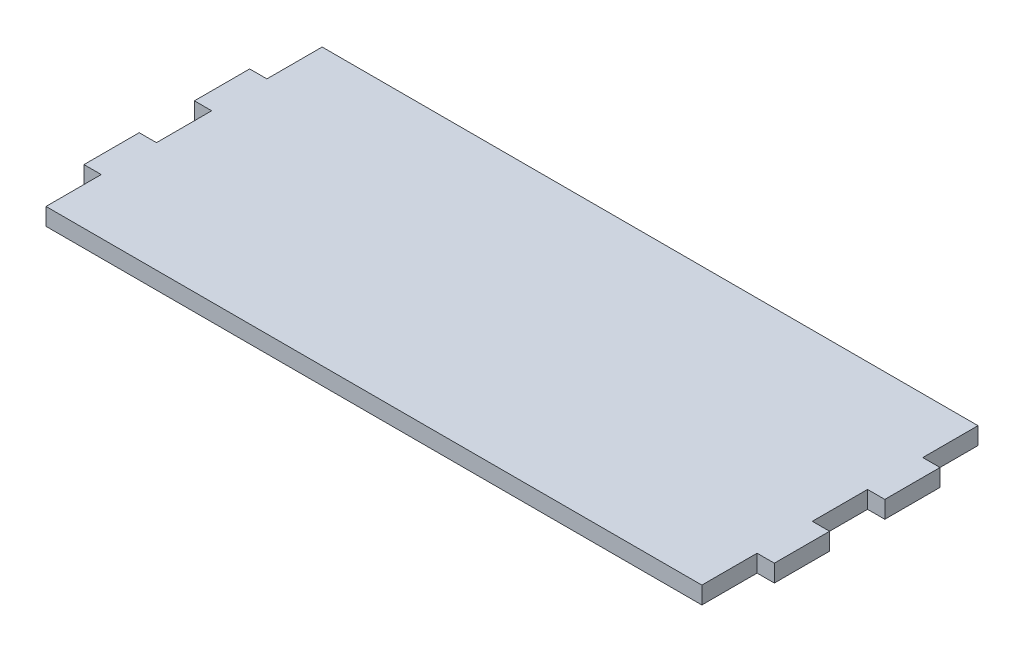
ISO-10303-21;
HEADER;
FILE_DESCRIPTION(('STEP AP214'),'2;1');
FILE_NAME('part.step','',(''),(''),'','','');
FILE_SCHEMA(('AUTOMOTIVE_DESIGN { 1 0 10303 214 1 1 1 1 }'));
ENDSEC;
DATA;
#1=APPLICATION_CONTEXT('core data for automotive mechanical design processes');
#2=APPLICATION_PROTOCOL_DEFINITION('international standard','automotive_design',2000,#1);
#3=PRODUCT_CONTEXT('',#1,'mechanical');
#4=PRODUCT('Part','Part','',(#3));
#5=PRODUCT_RELATED_PRODUCT_CATEGORY('part','',(#4));
#6=PRODUCT_DEFINITION_FORMATION('','',#4);
#7=PRODUCT_DEFINITION_CONTEXT('part definition',#1,'design');
#8=PRODUCT_DEFINITION('design','',#6,#7);
#9=PRODUCT_DEFINITION_SHAPE('','',#8);
#10=(LENGTH_UNIT() NAMED_UNIT(*) SI_UNIT(.MILLI.,.METRE.));
#11=(NAMED_UNIT(*) PLANE_ANGLE_UNIT() SI_UNIT($,.RADIAN.));
#12=(NAMED_UNIT(*) SI_UNIT($,.STERADIAN.) SOLID_ANGLE_UNIT());
#13=UNCERTAINTY_MEASURE_WITH_UNIT(LENGTH_MEASURE(1.E-05),#10,'distance_accuracy_value','');
#14=(GEOMETRIC_REPRESENTATION_CONTEXT(3) GLOBAL_UNCERTAINTY_ASSIGNED_CONTEXT((#13)) GLOBAL_UNIT_ASSIGNED_CONTEXT((#10,
#11,#12)) REPRESENTATION_CONTEXT('',''));
#15=CARTESIAN_POINT('',(0.,0.,0.));
#16=DIRECTION('',(0.,0.,1.));
#17=DIRECTION('',(1.,0.,0.));
#18=AXIS2_PLACEMENT_3D('',#15,#16,#17);
#19=CARTESIAN_POINT('',(-122.5,5.,-40.));
#20=DIRECTION('',(0.,0.,1.));
#21=DIRECTION('',(1.,0.,0.));
#22=AXIS2_PLACEMENT_3D('',#19,#20,#21);
#23=PLANE('',#22);
#24=DIRECTION('',(-1.,0.,0.));
#25=VECTOR('',#24,1.);
#26=CARTESIAN_POINT('',(-122.5,0.,-40.));
#27=LINE('',#26,#25);
#28=CARTESIAN_POINT('',(67.5,0.,-40.));
#29=VERTEX_POINT('',#28);
#30=CARTESIAN_POINT('',(-122.5,0.,-40.));
#31=VERTEX_POINT('',#30);
#32=EDGE_CURVE('E201',#29,#31,#27,.T.);
#33=ORIENTED_EDGE('',*,*,#32,.T.);
#34=DIRECTION('',(0.,-1.,0.));
#35=VECTOR('',#34,1.);
#36=CARTESIAN_POINT('',(-122.5,5.,-40.));
#37=LINE('',#36,#35);
#38=CARTESIAN_POINT('',(-122.5,5.,-40.));
#39=VERTEX_POINT('',#38);
#40=EDGE_CURVE('E11',#39,#31,#37,.T.);
#41=ORIENTED_EDGE('',*,*,#40,.F.);
#42=DIRECTION('',(-1.,0.,0.));
#43=VECTOR('',#42,1.);
#44=CARTESIAN_POINT('',(-122.5,5.,-40.));
#45=LINE('',#44,#43);
#46=CARTESIAN_POINT('',(67.5,5.,-40.));
#47=VERTEX_POINT('',#46);
#48=EDGE_CURVE('E239',#47,#39,#45,.T.);
#49=ORIENTED_EDGE('',*,*,#48,.F.);
#50=DIRECTION('',(0.,-1.,0.));
#51=VECTOR('',#50,1.);
#52=CARTESIAN_POINT('',(67.5,5.,-40.));
#53=LINE('',#52,#51);
#54=EDGE_CURVE('E197',#47,#29,#53,.T.);
#55=ORIENTED_EDGE('',*,*,#54,.T.);
#56=EDGE_LOOP('',(#33,#41,#49,#55));
#57=FACE_BOUND('',#56,.T.);
#58=ADVANCED_FACE('F33',(#57),#23,.F.);
#59=CARTESIAN_POINT('',(-122.5,5.,-40.));
#60=DIRECTION('',(1.,0.,0.));
#61=DIRECTION('',(0.,0.,-1.));
#62=AXIS2_PLACEMENT_3D('',#59,#60,#61);
#63=PLANE('',#62);
#64=DIRECTION('',(0.,0.,1.));
#65=VECTOR('',#64,1.);
#66=CARTESIAN_POINT('',(-122.5,0.,-40.));
#67=LINE('',#66,#65);
#68=CARTESIAN_POINT('',(-122.5,0.,-24.));
#69=VERTEX_POINT('',#68);
#70=EDGE_CURVE('E204',#31,#69,#67,.T.);
#71=ORIENTED_EDGE('',*,*,#70,.T.);
#72=DIRECTION('',(0.,-1.,0.));
#73=VECTOR('',#72,1.);
#74=CARTESIAN_POINT('',(-122.5,5.,-24.));
#75=LINE('',#74,#73);
#76=CARTESIAN_POINT('',(-122.5,5.,-24.));
#77=VERTEX_POINT('',#76);
#78=EDGE_CURVE('E41',#77,#69,#75,.T.);
#79=ORIENTED_EDGE('',*,*,#78,.F.);
#80=DIRECTION('',(0.,0.,1.));
#81=VECTOR('',#80,1.);
#82=CARTESIAN_POINT('',(-122.5,5.,-40.));
#83=LINE('',#82,#81);
#84=EDGE_CURVE('E128',#39,#77,#83,.T.);
#85=ORIENTED_EDGE('',*,*,#84,.F.);
#86=ORIENTED_EDGE('',*,*,#40,.T.);
#87=EDGE_LOOP('',(#71,#79,#85,#86));
#88=FACE_BOUND('',#87,.T.);
#89=ADVANCED_FACE('F357',(#88),#63,.F.);
#90=CARTESIAN_POINT('',(-127.5,5.,-24.));
#91=DIRECTION('',(0.,0.,1.));
#92=DIRECTION('',(1.,0.,0.));
#93=AXIS2_PLACEMENT_3D('',#90,#91,#92);
#94=PLANE('',#93);
#95=DIRECTION('',(-1.,0.,0.));
#96=VECTOR('',#95,1.);
#97=CARTESIAN_POINT('',(-127.5,0.,-24.));
#98=LINE('',#97,#96);
#99=CARTESIAN_POINT('',(-127.5,0.,-24.));
#100=VERTEX_POINT('',#99);
#101=EDGE_CURVE('E206',#69,#100,#98,.T.);
#102=ORIENTED_EDGE('',*,*,#101,.T.);
#103=DIRECTION('',(0.,-1.,0.));
#104=VECTOR('',#103,1.);
#105=CARTESIAN_POINT('',(-127.5,5.,-24.));
#106=LINE('',#105,#104);
#107=CARTESIAN_POINT('',(-127.5,5.,-24.));
#108=VERTEX_POINT('',#107);
#109=EDGE_CURVE('E282',#108,#100,#106,.T.);
#110=ORIENTED_EDGE('',*,*,#109,.F.);
#111=DIRECTION('',(-1.,0.,0.));
#112=VECTOR('',#111,1.);
#113=CARTESIAN_POINT('',(-127.5,5.,-24.));
#114=LINE('',#113,#112);
#115=EDGE_CURVE('E290',#77,#108,#114,.T.);
#116=ORIENTED_EDGE('',*,*,#115,.F.);
#117=ORIENTED_EDGE('',*,*,#78,.T.);
#118=EDGE_LOOP('',(#102,#110,#116,#117));
#119=FACE_BOUND('',#118,.T.);
#120=ADVANCED_FACE('F288',(#119),#94,.F.);
#121=CARTESIAN_POINT('',(-127.5,5.,-24.));
#122=DIRECTION('',(1.,0.,0.));
#123=DIRECTION('',(0.,0.,-1.));
#124=AXIS2_PLACEMENT_3D('',#121,#122,#123);
#125=PLANE('',#124);
#126=DIRECTION('',(0.,0.,1.));
#127=VECTOR('',#126,1.);
#128=CARTESIAN_POINT('',(-127.5,0.,-24.));
#129=LINE('',#128,#127);
#130=CARTESIAN_POINT('',(-127.5,0.,-8.00000000000001));
#131=VERTEX_POINT('',#130);
#132=EDGE_CURVE('E208',#100,#131,#129,.T.);
#133=ORIENTED_EDGE('',*,*,#132,.T.);
#134=DIRECTION('',(0.,-1.,0.));
#135=VECTOR('',#134,1.);
#136=CARTESIAN_POINT('',(-127.5,5.,-8.00000000000001));
#137=LINE('',#136,#135);
#138=CARTESIAN_POINT('',(-127.5,5.,-8.00000000000001));
#139=VERTEX_POINT('',#138);
#140=EDGE_CURVE('E279',#139,#131,#137,.T.);
#141=ORIENTED_EDGE('',*,*,#140,.F.);
#142=DIRECTION('',(0.,0.,1.));
#143=VECTOR('',#142,1.);
#144=CARTESIAN_POINT('',(-127.5,5.,-24.));
#145=LINE('',#144,#143);
#146=EDGE_CURVE('E308',#108,#139,#145,.T.);
#147=ORIENTED_EDGE('',*,*,#146,.F.);
#148=ORIENTED_EDGE('',*,*,#109,.T.);
#149=EDGE_LOOP('',(#133,#141,#147,#148));
#150=FACE_BOUND('',#149,.T.);
#151=ADVANCED_FACE('F299',(#150),#125,.F.);
#152=CARTESIAN_POINT('',(-127.5,5.,-8.00000000000001));
#153=DIRECTION('',(0.,0.,-1.));
#154=DIRECTION('',(-1.,0.,0.));
#155=AXIS2_PLACEMENT_3D('',#152,#153,#154);
#156=PLANE('',#155);
#157=DIRECTION('',(1.,0.,0.));
#158=VECTOR('',#157,1.);
#159=CARTESIAN_POINT('',(-127.5,0.,-8.00000000000001));
#160=LINE('',#159,#158);
#161=CARTESIAN_POINT('',(-122.5,0.,-8.));
#162=VERTEX_POINT('',#161);
#163=EDGE_CURVE('E210',#131,#162,#160,.T.);
#164=ORIENTED_EDGE('',*,*,#163,.T.);
#165=DIRECTION('',(0.,-1.,0.));
#166=VECTOR('',#165,1.);
#167=CARTESIAN_POINT('',(-122.5,5.,-8.));
#168=LINE('',#167,#166);
#169=CARTESIAN_POINT('',(-122.5,5.,-8.));
#170=VERTEX_POINT('',#169);
#171=EDGE_CURVE('E276',#170,#162,#168,.T.);
#172=ORIENTED_EDGE('',*,*,#171,.F.);
#173=DIRECTION('',(1.,0.,0.));
#174=VECTOR('',#173,1.);
#175=CARTESIAN_POINT('',(-127.5,5.,-8.00000000000001));
#176=LINE('',#175,#174);
#177=EDGE_CURVE('E305',#139,#170,#176,.T.);
#178=ORIENTED_EDGE('',*,*,#177,.F.);
#179=ORIENTED_EDGE('',*,*,#140,.T.);
#180=EDGE_LOOP('',(#164,#172,#178,#179));
#181=FACE_BOUND('',#180,.T.);
#182=ADVANCED_FACE('F303',(#181),#156,.F.);
#183=CARTESIAN_POINT('',(-122.5,5.,-8.));
#184=DIRECTION('',(1.,0.,0.));
#185=DIRECTION('',(0.,0.,-1.));
#186=AXIS2_PLACEMENT_3D('',#183,#184,#185);
#187=PLANE('',#186);
#188=DIRECTION('',(0.,0.,1.));
#189=VECTOR('',#188,1.);
#190=CARTESIAN_POINT('',(-122.5,0.,-8.));
#191=LINE('',#190,#189);
#192=CARTESIAN_POINT('',(-122.5,0.,7.99999999999999));
#193=VERTEX_POINT('',#192);
#194=EDGE_CURVE('E212',#162,#193,#191,.T.);
#195=ORIENTED_EDGE('',*,*,#194,.T.);
#196=DIRECTION('',(0.,-1.,0.));
#197=VECTOR('',#196,1.);
#198=CARTESIAN_POINT('',(-122.5,5.,7.99999999999999));
#199=LINE('',#198,#197);
#200=CARTESIAN_POINT('',(-122.5,5.,7.99999999999999));
#201=VERTEX_POINT('',#200);
#202=EDGE_CURVE('E273',#201,#193,#199,.T.);
#203=ORIENTED_EDGE('',*,*,#202,.F.);
#204=DIRECTION('',(0.,0.,1.));
#205=VECTOR('',#204,1.);
#206=CARTESIAN_POINT('',(-122.5,5.,-8.));
#207=LINE('',#206,#205);
#208=EDGE_CURVE('E307',#170,#201,#207,.T.);
#209=ORIENTED_EDGE('',*,*,#208,.F.);
#210=ORIENTED_EDGE('',*,*,#171,.T.);
#211=EDGE_LOOP('',(#195,#203,#209,#210));
#212=FACE_BOUND('',#211,.T.);
#213=ADVANCED_FACE('F370',(#212),#187,.F.);
#214=CARTESIAN_POINT('',(-127.5,5.,7.99999999999998));
#215=DIRECTION('',(0.,0.,1.));
#216=DIRECTION('',(1.,0.,0.));
#217=AXIS2_PLACEMENT_3D('',#214,#215,#216);
#218=PLANE('',#217);
#219=DIRECTION('',(-1.,0.,0.));
#220=VECTOR('',#219,1.);
#221=CARTESIAN_POINT('',(-127.5,0.,7.99999999999998));
#222=LINE('',#221,#220);
#223=CARTESIAN_POINT('',(-127.5,0.,7.99999999999998));
#224=VERTEX_POINT('',#223);
#225=EDGE_CURVE('E214',#193,#224,#222,.T.);
#226=ORIENTED_EDGE('',*,*,#225,.T.);
#227=DIRECTION('',(0.,-1.,0.));
#228=VECTOR('',#227,1.);
#229=CARTESIAN_POINT('',(-127.5,5.,7.99999999999998));
#230=LINE('',#229,#228);
#231=CARTESIAN_POINT('',(-127.5,5.,7.99999999999998));
#232=VERTEX_POINT('',#231);
#233=EDGE_CURVE('E270',#232,#224,#230,.T.);
#234=ORIENTED_EDGE('',*,*,#233,.F.);
#235=DIRECTION('',(-1.,0.,0.));
#236=VECTOR('',#235,1.);
#237=CARTESIAN_POINT('',(-127.5,5.,7.99999999999998));
#238=LINE('',#237,#236);
#239=EDGE_CURVE('E310',#201,#232,#238,.T.);
#240=ORIENTED_EDGE('',*,*,#239,.F.);
#241=ORIENTED_EDGE('',*,*,#202,.T.);
#242=EDGE_LOOP('',(#226,#234,#240,#241));
#243=FACE_BOUND('',#242,.T.);
#244=ADVANCED_FACE('F373',(#243),#218,.F.);
#245=CARTESIAN_POINT('',(-127.5,5.,7.99999999999998));
#246=DIRECTION('',(1.,0.,0.));
#247=DIRECTION('',(0.,0.,-1.));
#248=AXIS2_PLACEMENT_3D('',#245,#246,#247);
#249=PLANE('',#248);
#250=DIRECTION('',(0.,0.,1.));
#251=VECTOR('',#250,1.);
#252=CARTESIAN_POINT('',(-127.5,0.,7.99999999999998));
#253=LINE('',#252,#251);
#254=CARTESIAN_POINT('',(-127.5,0.,24.));
#255=VERTEX_POINT('',#254);
#256=EDGE_CURVE('E216',#224,#255,#253,.T.);
#257=ORIENTED_EDGE('',*,*,#256,.T.);
#258=DIRECTION('',(0.,-1.,0.));
#259=VECTOR('',#258,1.);
#260=CARTESIAN_POINT('',(-127.5,5.,24.));
#261=LINE('',#260,#259);
#262=CARTESIAN_POINT('',(-127.5,5.,24.));
#263=VERTEX_POINT('',#262);
#264=EDGE_CURVE('E267',#263,#255,#261,.T.);
#265=ORIENTED_EDGE('',*,*,#264,.F.);
#266=DIRECTION('',(0.,0.,1.));
#267=VECTOR('',#266,1.);
#268=CARTESIAN_POINT('',(-127.5,5.,7.99999999999998));
#269=LINE('',#268,#267);
#270=EDGE_CURVE('E316',#232,#263,#269,.T.);
#271=ORIENTED_EDGE('',*,*,#270,.F.);
#272=ORIENTED_EDGE('',*,*,#233,.T.);
#273=EDGE_LOOP('',(#257,#265,#271,#272));
#274=FACE_BOUND('',#273,.T.);
#275=ADVANCED_FACE('F377',(#274),#249,.F.);
#276=CARTESIAN_POINT('',(-127.5,5.,24.));
#277=DIRECTION('',(0.,0.,-1.));
#278=DIRECTION('',(-1.,0.,0.));
#279=AXIS2_PLACEMENT_3D('',#276,#277,#278);
#280=PLANE('',#279);
#281=DIRECTION('',(1.,0.,0.));
#282=VECTOR('',#281,1.);
#283=CARTESIAN_POINT('',(-127.5,0.,24.));
#284=LINE('',#283,#282);
#285=CARTESIAN_POINT('',(-122.5,0.,24.));
#286=VERTEX_POINT('',#285);
#287=EDGE_CURVE('E218',#255,#286,#284,.T.);
#288=ORIENTED_EDGE('',*,*,#287,.T.);
#289=DIRECTION('',(0.,-1.,0.));
#290=VECTOR('',#289,1.);
#291=CARTESIAN_POINT('',(-122.5,5.,24.));
#292=LINE('',#291,#290);
#293=CARTESIAN_POINT('',(-122.5,5.,24.));
#294=VERTEX_POINT('',#293);
#295=EDGE_CURVE('E264',#294,#286,#292,.T.);
#296=ORIENTED_EDGE('',*,*,#295,.F.);
#297=DIRECTION('',(1.,0.,0.));
#298=VECTOR('',#297,1.);
#299=CARTESIAN_POINT('',(-127.5,5.,24.));
#300=LINE('',#299,#298);
#301=EDGE_CURVE('E318',#263,#294,#300,.T.);
#302=ORIENTED_EDGE('',*,*,#301,.F.);
#303=ORIENTED_EDGE('',*,*,#264,.T.);
#304=EDGE_LOOP('',(#288,#296,#302,#303));
#305=FACE_BOUND('',#304,.T.);
#306=ADVANCED_FACE('F381',(#305),#280,.F.);
#307=CARTESIAN_POINT('',(-122.5,5.,24.));
#308=DIRECTION('',(1.,0.,0.));
#309=DIRECTION('',(0.,0.,-1.));
#310=AXIS2_PLACEMENT_3D('',#307,#308,#309);
#311=PLANE('',#310);
#312=DIRECTION('',(0.,0.,1.));
#313=VECTOR('',#312,1.);
#314=CARTESIAN_POINT('',(-122.5,0.,24.));
#315=LINE('',#314,#313);
#316=CARTESIAN_POINT('',(-122.5,0.,40.));
#317=VERTEX_POINT('',#316);
#318=EDGE_CURVE('E220',#286,#317,#315,.T.);
#319=ORIENTED_EDGE('',*,*,#318,.T.);
#320=DIRECTION('',(0.,-1.,0.));
#321=VECTOR('',#320,1.);
#322=CARTESIAN_POINT('',(-122.5,5.,40.));
#323=LINE('',#322,#321);
#324=CARTESIAN_POINT('',(-122.5,5.,40.));
#325=VERTEX_POINT('',#324);
#326=EDGE_CURVE('E261',#325,#317,#323,.T.);
#327=ORIENTED_EDGE('',*,*,#326,.F.);
#328=DIRECTION('',(0.,0.,1.));
#329=VECTOR('',#328,1.);
#330=CARTESIAN_POINT('',(-122.5,5.,24.));
#331=LINE('',#330,#329);
#332=EDGE_CURVE('E320',#294,#325,#331,.T.);
#333=ORIENTED_EDGE('',*,*,#332,.F.);
#334=ORIENTED_EDGE('',*,*,#295,.T.);
#335=EDGE_LOOP('',(#319,#327,#333,#334));
#336=FACE_BOUND('',#335,.T.);
#337=ADVANCED_FACE('F385',(#336),#311,.F.);
#338=CARTESIAN_POINT('',(-122.5,5.,40.));
#339=DIRECTION('',(0.,0.,-1.));
#340=DIRECTION('',(-1.,0.,0.));
#341=AXIS2_PLACEMENT_3D('',#338,#339,#340);
#342=PLANE('',#341);
#343=DIRECTION('',(1.,0.,0.));
#344=VECTOR('',#343,1.);
#345=CARTESIAN_POINT('',(-122.5,0.,40.));
#346=LINE('',#345,#344);
#347=CARTESIAN_POINT('',(67.5,0.,40.));
#348=VERTEX_POINT('',#347);
#349=EDGE_CURVE('E222',#317,#348,#346,.T.);
#350=ORIENTED_EDGE('',*,*,#349,.T.);
#351=DIRECTION('',(0.,-1.,0.));
#352=VECTOR('',#351,1.);
#353=CARTESIAN_POINT('',(67.5,5.,40.));
#354=LINE('',#353,#352);
#355=CARTESIAN_POINT('',(67.5,5.,40.));
#356=VERTEX_POINT('',#355);
#357=EDGE_CURVE('E258',#356,#348,#354,.T.);
#358=ORIENTED_EDGE('',*,*,#357,.F.);
#359=DIRECTION('',(1.,0.,0.));
#360=VECTOR('',#359,1.);
#361=CARTESIAN_POINT('',(-122.5,5.,40.));
#362=LINE('',#361,#360);
#363=EDGE_CURVE('E322',#325,#356,#362,.T.);
#364=ORIENTED_EDGE('',*,*,#363,.F.);
#365=ORIENTED_EDGE('',*,*,#326,.T.);
#366=EDGE_LOOP('',(#350,#358,#364,#365));
#367=FACE_BOUND('',#366,.T.);
#368=ADVANCED_FACE('F389',(#367),#342,.F.);
#369=CARTESIAN_POINT('',(67.5,5.,24.));
#370=DIRECTION('',(-1.,0.,0.));
#371=DIRECTION('',(0.,0.,1.));
#372=AXIS2_PLACEMENT_3D('',#369,#370,#371);
#373=PLANE('',#372);
#374=DIRECTION('',(0.,0.,-1.));
#375=VECTOR('',#374,1.);
#376=CARTESIAN_POINT('',(67.5,0.,24.));
#377=LINE('',#376,#375);
#378=CARTESIAN_POINT('',(67.5,0.,24.));
#379=VERTEX_POINT('',#378);
#380=EDGE_CURVE('E224',#348,#379,#377,.T.);
#381=ORIENTED_EDGE('',*,*,#380,.T.);
#382=DIRECTION('',(0.,-1.,0.));
#383=VECTOR('',#382,1.);
#384=CARTESIAN_POINT('',(67.5,5.,24.));
#385=LINE('',#384,#383);
#386=CARTESIAN_POINT('',(67.5,5.,24.));
#387=VERTEX_POINT('',#386);
#388=EDGE_CURVE('E255',#387,#379,#385,.T.);
#389=ORIENTED_EDGE('',*,*,#388,.F.);
#390=DIRECTION('',(0.,0.,-1.));
#391=VECTOR('',#390,1.);
#392=CARTESIAN_POINT('',(67.5,5.,24.));
#393=LINE('',#392,#391);
#394=EDGE_CURVE('E324',#356,#387,#393,.T.);
#395=ORIENTED_EDGE('',*,*,#394,.F.);
#396=ORIENTED_EDGE('',*,*,#357,.T.);
#397=EDGE_LOOP('',(#381,#389,#395,#396));
#398=FACE_BOUND('',#397,.T.);
#399=ADVANCED_FACE('F393',(#398),#373,.F.);
#400=CARTESIAN_POINT('',(67.5,5.,24.));
#401=DIRECTION('',(0.,0.,-1.));
#402=DIRECTION('',(-1.,0.,0.));
#403=AXIS2_PLACEMENT_3D('',#400,#401,#402);
#404=PLANE('',#403);
#405=DIRECTION('',(1.,0.,0.));
#406=VECTOR('',#405,1.);
#407=CARTESIAN_POINT('',(67.5,0.,24.));
#408=LINE('',#407,#406);
#409=CARTESIAN_POINT('',(72.5,0.,24.));
#410=VERTEX_POINT('',#409);
#411=EDGE_CURVE('E226',#379,#410,#408,.T.);
#412=ORIENTED_EDGE('',*,*,#411,.T.);
#413=DIRECTION('',(0.,-1.,0.));
#414=VECTOR('',#413,1.);
#415=CARTESIAN_POINT('',(72.5,5.,24.));
#416=LINE('',#415,#414);
#417=CARTESIAN_POINT('',(72.5,5.,24.));
#418=VERTEX_POINT('',#417);
#419=EDGE_CURVE('E252',#418,#410,#416,.T.);
#420=ORIENTED_EDGE('',*,*,#419,.F.);
#421=DIRECTION('',(1.,0.,0.));
#422=VECTOR('',#421,1.);
#423=CARTESIAN_POINT('',(67.5,5.,24.));
#424=LINE('',#423,#422);
#425=EDGE_CURVE('E326',#387,#418,#424,.T.);
#426=ORIENTED_EDGE('',*,*,#425,.F.);
#427=ORIENTED_EDGE('',*,*,#388,.T.);
#428=EDGE_LOOP('',(#412,#420,#426,#427));
#429=FACE_BOUND('',#428,.T.);
#430=ADVANCED_FACE('F397',(#429),#404,.F.);
#431=CARTESIAN_POINT('',(72.5,5.,7.99999999999999));
#432=DIRECTION('',(-1.,0.,0.));
#433=DIRECTION('',(0.,0.,1.));
#434=AXIS2_PLACEMENT_3D('',#431,#432,#433);
#435=PLANE('',#434);
#436=DIRECTION('',(0.,0.,-1.));
#437=VECTOR('',#436,1.);
#438=CARTESIAN_POINT('',(72.5,0.,7.99999999999999));
#439=LINE('',#438,#437);
#440=CARTESIAN_POINT('',(72.5,0.,7.99999999999999));
#441=VERTEX_POINT('',#440);
#442=EDGE_CURVE('E228',#410,#441,#439,.T.);
#443=ORIENTED_EDGE('',*,*,#442,.T.);
#444=DIRECTION('',(0.,-1.,0.));
#445=VECTOR('',#444,1.);
#446=CARTESIAN_POINT('',(72.5,5.,7.99999999999999));
#447=LINE('',#446,#445);
#448=CARTESIAN_POINT('',(72.5,5.,7.99999999999999));
#449=VERTEX_POINT('',#448);
#450=EDGE_CURVE('E249',#449,#441,#447,.T.);
#451=ORIENTED_EDGE('',*,*,#450,.F.);
#452=DIRECTION('',(0.,0.,-1.));
#453=VECTOR('',#452,1.);
#454=CARTESIAN_POINT('',(72.5,5.,7.99999999999999));
#455=LINE('',#454,#453);
#456=EDGE_CURVE('E328',#418,#449,#455,.T.);
#457=ORIENTED_EDGE('',*,*,#456,.F.);
#458=ORIENTED_EDGE('',*,*,#419,.T.);
#459=EDGE_LOOP('',(#443,#451,#457,#458));
#460=FACE_BOUND('',#459,.T.);
#461=ADVANCED_FACE('F401',(#460),#435,.F.);
#462=CARTESIAN_POINT('',(67.5,5.,7.99999999999999));
#463=DIRECTION('',(0.,0.,1.));
#464=DIRECTION('',(1.,0.,0.));
#465=AXIS2_PLACEMENT_3D('',#462,#463,#464);
#466=PLANE('',#465);
#467=DIRECTION('',(-1.,0.,0.));
#468=VECTOR('',#467,1.);
#469=CARTESIAN_POINT('',(67.5,0.,7.99999999999999));
#470=LINE('',#469,#468);
#471=CARTESIAN_POINT('',(67.5,0.,7.99999999999999));
#472=VERTEX_POINT('',#471);
#473=EDGE_CURVE('E230',#441,#472,#470,.T.);
#474=ORIENTED_EDGE('',*,*,#473,.T.);
#475=DIRECTION('',(0.,-1.,0.));
#476=VECTOR('',#475,1.);
#477=CARTESIAN_POINT('',(67.5,5.,7.99999999999999));
#478=LINE('',#477,#476);
#479=CARTESIAN_POINT('',(67.5,5.,7.99999999999999));
#480=VERTEX_POINT('',#479);
#481=EDGE_CURVE('E246',#480,#472,#478,.T.);
#482=ORIENTED_EDGE('',*,*,#481,.F.);
#483=DIRECTION('',(-1.,0.,0.));
#484=VECTOR('',#483,1.);
#485=CARTESIAN_POINT('',(67.5,5.,7.99999999999999));
#486=LINE('',#485,#484);
#487=EDGE_CURVE('E330',#449,#480,#486,.T.);
#488=ORIENTED_EDGE('',*,*,#487,.F.);
#489=ORIENTED_EDGE('',*,*,#450,.T.);
#490=EDGE_LOOP('',(#474,#482,#488,#489));
#491=FACE_BOUND('',#490,.T.);
#492=ADVANCED_FACE('F405',(#491),#466,.F.);
#493=CARTESIAN_POINT('',(67.5,5.,-8.00000000000001));
#494=DIRECTION('',(-1.,0.,0.));
#495=DIRECTION('',(0.,0.,1.));
#496=AXIS2_PLACEMENT_3D('',#493,#494,#495);
#497=PLANE('',#496);
#498=DIRECTION('',(0.,0.,-1.));
#499=VECTOR('',#498,1.);
#500=CARTESIAN_POINT('',(67.5,0.,-8.00000000000001));
#501=LINE('',#500,#499);
#502=CARTESIAN_POINT('',(67.5,0.,-8.00000000000001));
#503=VERTEX_POINT('',#502);
#504=EDGE_CURVE('E232',#472,#503,#501,.T.);
#505=ORIENTED_EDGE('',*,*,#504,.T.);
#506=DIRECTION('',(0.,-1.,0.));
#507=VECTOR('',#506,1.);
#508=CARTESIAN_POINT('',(67.5,5.,-8.00000000000001));
#509=LINE('',#508,#507);
#510=CARTESIAN_POINT('',(67.5,5.,-8.00000000000001));
#511=VERTEX_POINT('',#510);
#512=EDGE_CURVE('E243',#511,#503,#509,.T.);
#513=ORIENTED_EDGE('',*,*,#512,.F.);
#514=DIRECTION('',(0.,0.,-1.));
#515=VECTOR('',#514,1.);
#516=CARTESIAN_POINT('',(67.5,5.,-8.00000000000001));
#517=LINE('',#516,#515);
#518=EDGE_CURVE('E332',#480,#511,#517,.T.);
#519=ORIENTED_EDGE('',*,*,#518,.F.);
#520=ORIENTED_EDGE('',*,*,#481,.T.);
#521=EDGE_LOOP('',(#505,#513,#519,#520));
#522=FACE_BOUND('',#521,.T.);
#523=ADVANCED_FACE('F338',(#522),#497,.F.);
#524=CARTESIAN_POINT('',(67.5,5.,-8.00000000000001));
#525=DIRECTION('',(0.,0.,-1.));
#526=DIRECTION('',(-1.,0.,0.));
#527=AXIS2_PLACEMENT_3D('',#524,#525,#526);
#528=PLANE('',#527);
#529=DIRECTION('',(1.,0.,0.));
#530=VECTOR('',#529,1.);
#531=CARTESIAN_POINT('',(67.5,0.,-8.00000000000001));
#532=LINE('',#531,#530);
#533=CARTESIAN_POINT('',(72.5,0.,-8.00000000000001));
#534=VERTEX_POINT('',#533);
#535=EDGE_CURVE('E234',#503,#534,#532,.T.);
#536=ORIENTED_EDGE('',*,*,#535,.T.);
#537=DIRECTION('',(0.,-1.,0.));
#538=VECTOR('',#537,1.);
#539=CARTESIAN_POINT('',(72.5,5.,-8.00000000000001));
#540=LINE('',#539,#538);
#541=CARTESIAN_POINT('',(72.5,5.,-8.00000000000001));
#542=VERTEX_POINT('',#541);
#543=EDGE_CURVE('E192',#542,#534,#540,.T.);
#544=ORIENTED_EDGE('',*,*,#543,.F.);
#545=DIRECTION('',(1.,0.,0.));
#546=VECTOR('',#545,1.);
#547=CARTESIAN_POINT('',(67.5,5.,-8.00000000000001));
#548=LINE('',#547,#546);
#549=EDGE_CURVE('E183',#511,#542,#548,.T.);
#550=ORIENTED_EDGE('',*,*,#549,.F.);
#551=ORIENTED_EDGE('',*,*,#512,.T.);
#552=EDGE_LOOP('',(#536,#544,#550,#551));
#553=FACE_BOUND('',#552,.T.);
#554=ADVANCED_FACE('F342',(#553),#528,.F.);
#555=CARTESIAN_POINT('',(72.5,5.,-24.));
#556=DIRECTION('',(-1.,0.,0.));
#557=DIRECTION('',(0.,0.,1.));
#558=AXIS2_PLACEMENT_3D('',#555,#556,#557);
#559=PLANE('',#558);
#560=DIRECTION('',(0.,0.,-1.));
#561=VECTOR('',#560,1.);
#562=CARTESIAN_POINT('',(72.5,0.,-24.));
#563=LINE('',#562,#561);
#564=CARTESIAN_POINT('',(72.5,0.,-24.));
#565=VERTEX_POINT('',#564);
#566=EDGE_CURVE('E191',#534,#565,#563,.T.);
#567=ORIENTED_EDGE('',*,*,#566,.T.);
#568=DIRECTION('',(0.,-1.,0.));
#569=VECTOR('',#568,1.);
#570=CARTESIAN_POINT('',(72.5,5.,-24.));
#571=LINE('',#570,#569);
#572=CARTESIAN_POINT('',(72.5,5.,-24.));
#573=VERTEX_POINT('',#572);
#574=EDGE_CURVE('E188',#573,#565,#571,.T.);
#575=ORIENTED_EDGE('',*,*,#574,.F.);
#576=DIRECTION('',(0.,0.,-1.));
#577=VECTOR('',#576,1.);
#578=CARTESIAN_POINT('',(72.5,5.,-24.));
#579=LINE('',#578,#577);
#580=EDGE_CURVE('E177',#542,#573,#579,.T.);
#581=ORIENTED_EDGE('',*,*,#580,.F.);
#582=ORIENTED_EDGE('',*,*,#543,.T.);
#583=EDGE_LOOP('',(#567,#575,#581,#582));
#584=FACE_BOUND('',#583,.T.);
#585=ADVANCED_FACE('F189',(#584),#559,.F.);
#586=CARTESIAN_POINT('',(67.5,5.,-24.));
#587=DIRECTION('',(0.,0.,1.));
#588=DIRECTION('',(1.,0.,0.));
#589=AXIS2_PLACEMENT_3D('',#586,#587,#588);
#590=PLANE('',#589);
#591=DIRECTION('',(-1.,0.,0.));
#592=VECTOR('',#591,1.);
#593=CARTESIAN_POINT('',(67.5,0.,-24.));
#594=LINE('',#593,#592);
#595=CARTESIAN_POINT('',(67.5,0.,-24.));
#596=VERTEX_POINT('',#595);
#597=EDGE_CURVE('E114',#565,#596,#594,.T.);
#598=ORIENTED_EDGE('',*,*,#597,.T.);
#599=DIRECTION('',(0.,-1.,0.));
#600=VECTOR('',#599,1.);
#601=CARTESIAN_POINT('',(67.5,5.,-24.));
#602=LINE('',#601,#600);
#603=CARTESIAN_POINT('',(67.5,5.,-24.));
#604=VERTEX_POINT('',#603);
#605=EDGE_CURVE('E193',#604,#596,#602,.T.);
#606=ORIENTED_EDGE('',*,*,#605,.F.);
#607=DIRECTION('',(-1.,0.,0.));
#608=VECTOR('',#607,1.);
#609=CARTESIAN_POINT('',(67.5,5.,-24.));
#610=LINE('',#609,#608);
#611=EDGE_CURVE('E181',#573,#604,#610,.T.);
#612=ORIENTED_EDGE('',*,*,#611,.F.);
#613=ORIENTED_EDGE('',*,*,#574,.T.);
#614=EDGE_LOOP('',(#598,#606,#612,#613));
#615=FACE_BOUND('',#614,.T.);
#616=ADVANCED_FACE('F195',(#615),#590,.F.);
#617=CARTESIAN_POINT('',(67.5,5.,-40.));
#618=DIRECTION('',(-1.,0.,0.));
#619=DIRECTION('',(0.,0.,1.));
#620=AXIS2_PLACEMENT_3D('',#617,#618,#619);
#621=PLANE('',#620);
#622=DIRECTION('',(0.,0.,-1.));
#623=VECTOR('',#622,1.);
#624=CARTESIAN_POINT('',(67.5,0.,-40.));
#625=LINE('',#624,#623);
#626=EDGE_CURVE('E120',#596,#29,#625,.T.);
#627=ORIENTED_EDGE('',*,*,#626,.T.);
#628=ORIENTED_EDGE('',*,*,#54,.F.);
#629=DIRECTION('',(0.,0.,-1.));
#630=VECTOR('',#629,1.);
#631=CARTESIAN_POINT('',(67.5,5.,-40.));
#632=LINE('',#631,#630);
#633=EDGE_CURVE('E49',#604,#47,#632,.T.);
#634=ORIENTED_EDGE('',*,*,#633,.F.);
#635=ORIENTED_EDGE('',*,*,#605,.T.);
#636=EDGE_LOOP('',(#627,#628,#634,#635));
#637=FACE_BOUND('',#636,.T.);
#638=ADVANCED_FACE('F346',(#637),#621,.F.);
#639=CARTESIAN_POINT('',(0.,5.,0.));
#640=DIRECTION('',(0.,-1.,0.));
#641=DIRECTION('',(0.,0.,-1.));
#642=AXIS2_PLACEMENT_3D('',#639,#640,#641);
#643=PLANE('',#642);
#644=ORIENTED_EDGE('',*,*,#48,.T.);
#645=ORIENTED_EDGE('',*,*,#84,.T.);
#646=ORIENTED_EDGE('',*,*,#115,.T.);
#647=ORIENTED_EDGE('',*,*,#146,.T.);
#648=ORIENTED_EDGE('',*,*,#177,.T.);
#649=ORIENTED_EDGE('',*,*,#208,.T.);
#650=ORIENTED_EDGE('',*,*,#239,.T.);
#651=ORIENTED_EDGE('',*,*,#270,.T.);
#652=ORIENTED_EDGE('',*,*,#301,.T.);
#653=ORIENTED_EDGE('',*,*,#332,.T.);
#654=ORIENTED_EDGE('',*,*,#363,.T.);
#655=ORIENTED_EDGE('',*,*,#394,.T.);
#656=ORIENTED_EDGE('',*,*,#425,.T.);
#657=ORIENTED_EDGE('',*,*,#456,.T.);
#658=ORIENTED_EDGE('',*,*,#487,.T.);
#659=ORIENTED_EDGE('',*,*,#518,.T.);
#660=ORIENTED_EDGE('',*,*,#549,.T.);
#661=ORIENTED_EDGE('',*,*,#580,.T.);
#662=ORIENTED_EDGE('',*,*,#611,.T.);
#663=ORIENTED_EDGE('',*,*,#633,.T.);
#664=EDGE_LOOP('',(#644,#645,#646,#647,#648,#649,#650,#651,#652,#653,#654,#655,#656,#657,#658,
#659,#660,#661,#662,#663));
#665=FACE_BOUND('',#664,.T.);
#666=ADVANCED_FACE('F179',(#665),#643,.F.);
#667=CARTESIAN_POINT('',(0.,0.,0.));
#668=DIRECTION('',(0.,-1.,0.));
#669=DIRECTION('',(0.,0.,-1.));
#670=AXIS2_PLACEMENT_3D('',#667,#668,#669);
#671=PLANE('',#670);
#672=ORIENTED_EDGE('',*,*,#32,.F.);
#673=ORIENTED_EDGE('',*,*,#626,.F.);
#674=ORIENTED_EDGE('',*,*,#597,.F.);
#675=ORIENTED_EDGE('',*,*,#566,.F.);
#676=ORIENTED_EDGE('',*,*,#535,.F.);
#677=ORIENTED_EDGE('',*,*,#504,.F.);
#678=ORIENTED_EDGE('',*,*,#473,.F.);
#679=ORIENTED_EDGE('',*,*,#442,.F.);
#680=ORIENTED_EDGE('',*,*,#411,.F.);
#681=ORIENTED_EDGE('',*,*,#380,.F.);
#682=ORIENTED_EDGE('',*,*,#349,.F.);
#683=ORIENTED_EDGE('',*,*,#318,.F.);
#684=ORIENTED_EDGE('',*,*,#287,.F.);
#685=ORIENTED_EDGE('',*,*,#256,.F.);
#686=ORIENTED_EDGE('',*,*,#225,.F.);
#687=ORIENTED_EDGE('',*,*,#194,.F.);
#688=ORIENTED_EDGE('',*,*,#163,.F.);
#689=ORIENTED_EDGE('',*,*,#132,.F.);
#690=ORIENTED_EDGE('',*,*,#101,.F.);
#691=ORIENTED_EDGE('',*,*,#70,.F.);
#692=EDGE_LOOP('',(#672,#673,#674,#675,#676,#677,#678,#679,#680,#681,#682,#683,#684,#685,#686,
#687,#688,#689,#690,#691));
#693=FACE_BOUND('',#692,.T.);
#694=ADVANCED_FACE('F294',(#693),#671,.T.);
#695=CLOSED_SHELL('',(#58,#89,#120,#151,#182,#213,#244,#275,#306,#337,#368,#399,#430,#461,#492,
#523,#554,#585,#616,#638,#666,#694));
#696=MANIFOLD_SOLID_BREP('B2',#695);
#697=ADVANCED_BREP_SHAPE_REPRESENTATION('',(#18,#696),#14);
#698=SHAPE_DEFINITION_REPRESENTATION(#9,#697);
ENDSEC;
END-ISO-10303-21;
